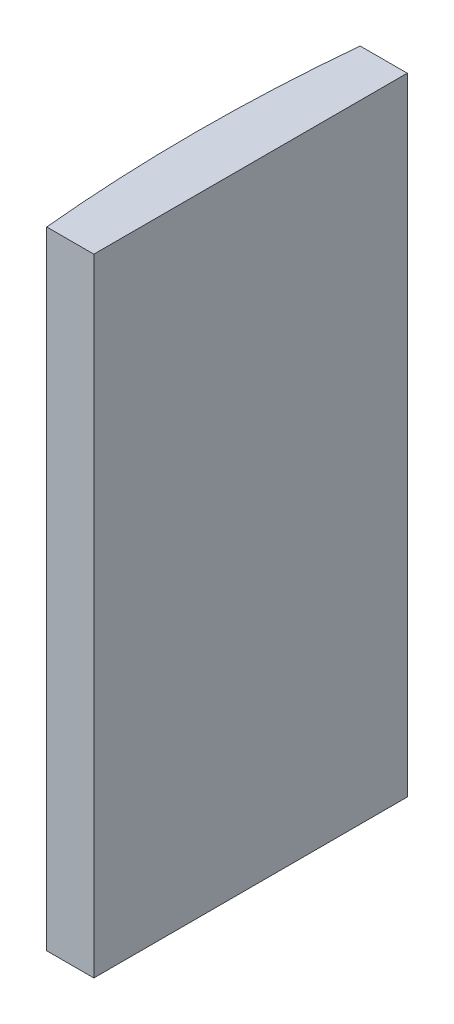
ISO-10303-21;
HEADER;
FILE_DESCRIPTION(('STEP AP214'),'2;1');
FILE_NAME('part.step','',(''),(''),'','','');
FILE_SCHEMA(('AUTOMOTIVE_DESIGN { 1 0 10303 214 1 1 1 1 }'));
ENDSEC;
DATA;
#1=APPLICATION_CONTEXT('core data for automotive mechanical design processes');
#2=APPLICATION_PROTOCOL_DEFINITION('international standard','automotive_design',2000,#1);
#3=PRODUCT_CONTEXT('',#1,'mechanical');
#4=PRODUCT('Part','Part','',(#3));
#5=PRODUCT_RELATED_PRODUCT_CATEGORY('part','',(#4));
#6=PRODUCT_DEFINITION_FORMATION('','',#4);
#7=PRODUCT_DEFINITION_CONTEXT('part definition',#1,'design');
#8=PRODUCT_DEFINITION('design','',#6,#7);
#9=PRODUCT_DEFINITION_SHAPE('','',#8);
#10=(LENGTH_UNIT() NAMED_UNIT(*) SI_UNIT(.MILLI.,.METRE.));
#11=(NAMED_UNIT(*) PLANE_ANGLE_UNIT() SI_UNIT($,.RADIAN.));
#12=(NAMED_UNIT(*) SI_UNIT($,.STERADIAN.) SOLID_ANGLE_UNIT());
#13=UNCERTAINTY_MEASURE_WITH_UNIT(LENGTH_MEASURE(1.E-05),#10,'distance_accuracy_value','');
#14=(GEOMETRIC_REPRESENTATION_CONTEXT(3) GLOBAL_UNCERTAINTY_ASSIGNED_CONTEXT((#13)) GLOBAL_UNIT_ASSIGNED_CONTEXT((#10,
#11,#12)) REPRESENTATION_CONTEXT('',''));
#15=CARTESIAN_POINT('',(0.,0.,0.));
#16=DIRECTION('',(0.,0.,1.));
#17=DIRECTION('',(1.,0.,0.));
#18=AXIS2_PLACEMENT_3D('',#15,#16,#17);
#19=CARTESIAN_POINT('',(4.35520433485127,40.,0.));
#20=DIRECTION('',(0.,-1.,0.));
#21=DIRECTION('',(0.,0.,-1.));
#22=AXIS2_PLACEMENT_3D('',#19,#20,#21);
#23=CYLINDRICAL_SURFACE('',#22,103.4);
#24=CARTESIAN_POINT('',(4.35520433485127,0.,0.));
#25=DIRECTION('',(0.,1.,0.));
#26=DIRECTION('',(0.,0.,1.));
#27=AXIS2_PLACEMENT_3D('',#24,#25,#26);
#28=CIRCLE('',#27,103.4);
#29=CARTESIAN_POINT('',(-98.560100649393,0.,-10.));
#30=VERTEX_POINT('',#29);
#31=CARTESIAN_POINT('',(-98.560100649393,0.,10.));
#32=VERTEX_POINT('',#31);
#33=EDGE_CURVE('E111',#30,#32,#28,.T.);
#34=ORIENTED_EDGE('',*,*,#33,.T.);
#35=DIRECTION('',(0.,-1.,0.));
#36=VECTOR('',#35,1.);
#37=CARTESIAN_POINT('',(-98.560100649393,40.,10.));
#38=LINE('',#37,#36);
#39=CARTESIAN_POINT('',(-98.560100649393,40.,10.));
#40=VERTEX_POINT('',#39);
#41=EDGE_CURVE('E11',#40,#32,#38,.T.);
#42=ORIENTED_EDGE('',*,*,#41,.F.);
#43=CARTESIAN_POINT('',(4.35520433485127,40.,0.));
#44=DIRECTION('',(0.,1.,0.));
#45=DIRECTION('',(0.,0.,1.));
#46=AXIS2_PLACEMENT_3D('',#43,#44,#45);
#47=CIRCLE('',#46,103.4);
#48=CARTESIAN_POINT('',(-98.560100649393,40.,-10.));
#49=VERTEX_POINT('',#48);
#50=EDGE_CURVE('E93',#49,#40,#47,.T.);
#51=ORIENTED_EDGE('',*,*,#50,.F.);
#52=DIRECTION('',(0.,-1.,0.));
#53=VECTOR('',#52,1.);
#54=CARTESIAN_POINT('',(-98.560100649393,40.,-10.));
#55=LINE('',#54,#53);
#56=EDGE_CURVE('E107',#49,#30,#55,.T.);
#57=ORIENTED_EDGE('',*,*,#56,.T.);
#58=EDGE_LOOP('',(#34,#42,#51,#57));
#59=FACE_BOUND('',#58,.T.);
#60=ADVANCED_FACE('F41',(#59),#23,.T.);
#61=CARTESIAN_POINT('',(-98.560100649393,40.,10.));
#62=DIRECTION('',(0.,0.,-1.));
#63=DIRECTION('',(-1.,0.,0.));
#64=AXIS2_PLACEMENT_3D('',#61,#62,#63);
#65=PLANE('',#64);
#66=DIRECTION('',(1.,0.,0.));
#67=VECTOR('',#66,1.);
#68=CARTESIAN_POINT('',(-98.560100649393,0.,10.));
#69=LINE('',#68,#67);
#70=CARTESIAN_POINT('',(-95.5547956651487,0.,10.));
#71=VERTEX_POINT('',#70);
#72=EDGE_CURVE('E98',#32,#71,#69,.T.);
#73=ORIENTED_EDGE('',*,*,#72,.T.);
#74=DIRECTION('',(0.,-1.,0.));
#75=VECTOR('',#74,1.);
#76=CARTESIAN_POINT('',(-95.5547956651487,40.,10.));
#77=LINE('',#76,#75);
#78=CARTESIAN_POINT('',(-95.5547956651487,40.,10.));
#79=VERTEX_POINT('',#78);
#80=EDGE_CURVE('E50',#79,#71,#77,.T.);
#81=ORIENTED_EDGE('',*,*,#80,.F.);
#82=DIRECTION('',(1.,0.,0.));
#83=VECTOR('',#82,1.);
#84=CARTESIAN_POINT('',(-98.560100649393,40.,10.));
#85=LINE('',#84,#83);
#86=EDGE_CURVE('E88',#40,#79,#85,.T.);
#87=ORIENTED_EDGE('',*,*,#86,.F.);
#88=ORIENTED_EDGE('',*,*,#41,.T.);
#89=EDGE_LOOP('',(#73,#81,#87,#88));
#90=FACE_BOUND('',#89,.T.);
#91=ADVANCED_FACE('F97',(#90),#65,.F.);
#92=CARTESIAN_POINT('',(-95.5547956651487,40.,-10.));
#93=DIRECTION('',(-1.,0.,0.));
#94=DIRECTION('',(0.,0.,1.));
#95=AXIS2_PLACEMENT_3D('',#92,#93,#94);
#96=PLANE('',#95);
#97=DIRECTION('',(0.,0.,-1.));
#98=VECTOR('',#97,1.);
#99=CARTESIAN_POINT('',(-95.5547956651487,0.,-10.));
#100=LINE('',#99,#98);
#101=CARTESIAN_POINT('',(-95.5547956651487,0.,-10.));
#102=VERTEX_POINT('',#101);
#103=EDGE_CURVE('E75',#71,#102,#100,.T.);
#104=ORIENTED_EDGE('',*,*,#103,.T.);
#105=DIRECTION('',(0.,-1.,0.));
#106=VECTOR('',#105,1.);
#107=CARTESIAN_POINT('',(-95.5547956651487,40.,-10.));
#108=LINE('',#107,#106);
#109=CARTESIAN_POINT('',(-95.5547956651487,40.,-10.));
#110=VERTEX_POINT('',#109);
#111=EDGE_CURVE('E100',#110,#102,#108,.T.);
#112=ORIENTED_EDGE('',*,*,#111,.F.);
#113=DIRECTION('',(0.,0.,-1.));
#114=VECTOR('',#113,1.);
#115=CARTESIAN_POINT('',(-95.5547956651487,40.,-10.));
#116=LINE('',#115,#114);
#117=EDGE_CURVE('E91',#79,#110,#116,.T.);
#118=ORIENTED_EDGE('',*,*,#117,.F.);
#119=ORIENTED_EDGE('',*,*,#80,.T.);
#120=EDGE_LOOP('',(#104,#112,#118,#119));
#121=FACE_BOUND('',#120,.T.);
#122=ADVANCED_FACE('F101',(#121),#96,.F.);
#123=CARTESIAN_POINT('',(-98.560100649393,40.,-10.));
#124=DIRECTION('',(0.,0.,1.));
#125=DIRECTION('',(1.,0.,0.));
#126=AXIS2_PLACEMENT_3D('',#123,#124,#125);
#127=PLANE('',#126);
#128=DIRECTION('',(-1.,0.,0.));
#129=VECTOR('',#128,1.);
#130=CARTESIAN_POINT('',(-98.560100649393,0.,-10.));
#131=LINE('',#130,#129);
#132=EDGE_CURVE('E81',#102,#30,#131,.T.);
#133=ORIENTED_EDGE('',*,*,#132,.T.);
#134=ORIENTED_EDGE('',*,*,#56,.F.);
#135=DIRECTION('',(-1.,0.,0.));
#136=VECTOR('',#135,1.);
#137=CARTESIAN_POINT('',(-98.560100649393,40.,-10.));
#138=LINE('',#137,#136);
#139=EDGE_CURVE('E58',#110,#49,#138,.T.);
#140=ORIENTED_EDGE('',*,*,#139,.F.);
#141=ORIENTED_EDGE('',*,*,#111,.T.);
#142=EDGE_LOOP('',(#133,#134,#140,#141));
#143=FACE_BOUND('',#142,.T.);
#144=ADVANCED_FACE('F122',(#143),#127,.F.);
#145=CARTESIAN_POINT('',(4.35520433485127,40.,0.));
#146=DIRECTION('',(0.,1.,0.));
#147=DIRECTION('',(0.,0.,1.));
#148=AXIS2_PLACEMENT_3D('',#145,#146,#147);
#149=PLANE('',#148);
#150=ORIENTED_EDGE('',*,*,#50,.T.);
#151=ORIENTED_EDGE('',*,*,#86,.T.);
#152=ORIENTED_EDGE('',*,*,#117,.T.);
#153=ORIENTED_EDGE('',*,*,#139,.T.);
#154=EDGE_LOOP('',(#150,#151,#152,#153));
#155=FACE_BOUND('',#154,.T.);
#156=ADVANCED_FACE('F89',(#155),#149,.T.);
#157=CARTESIAN_POINT('',(4.35520433485127,0.,0.));
#158=DIRECTION('',(0.,1.,0.));
#159=DIRECTION('',(0.,0.,1.));
#160=AXIS2_PLACEMENT_3D('',#157,#158,#159);
#161=PLANE('',#160);
#162=ORIENTED_EDGE('',*,*,#33,.F.);
#163=ORIENTED_EDGE('',*,*,#132,.F.);
#164=ORIENTED_EDGE('',*,*,#103,.F.);
#165=ORIENTED_EDGE('',*,*,#72,.F.);
#166=EDGE_LOOP('',(#162,#163,#164,#165));
#167=FACE_BOUND('',#166,.T.);
#168=ADVANCED_FACE('F125',(#167),#161,.F.);
#169=CLOSED_SHELL('',(#60,#91,#122,#144,#156,#168));
#170=MANIFOLD_SOLID_BREP('B2',#169);
#171=ADVANCED_BREP_SHAPE_REPRESENTATION('',(#18,#170),#14);
#172=SHAPE_DEFINITION_REPRESENTATION(#9,#171);
ENDSEC;
END-ISO-10303-21;
